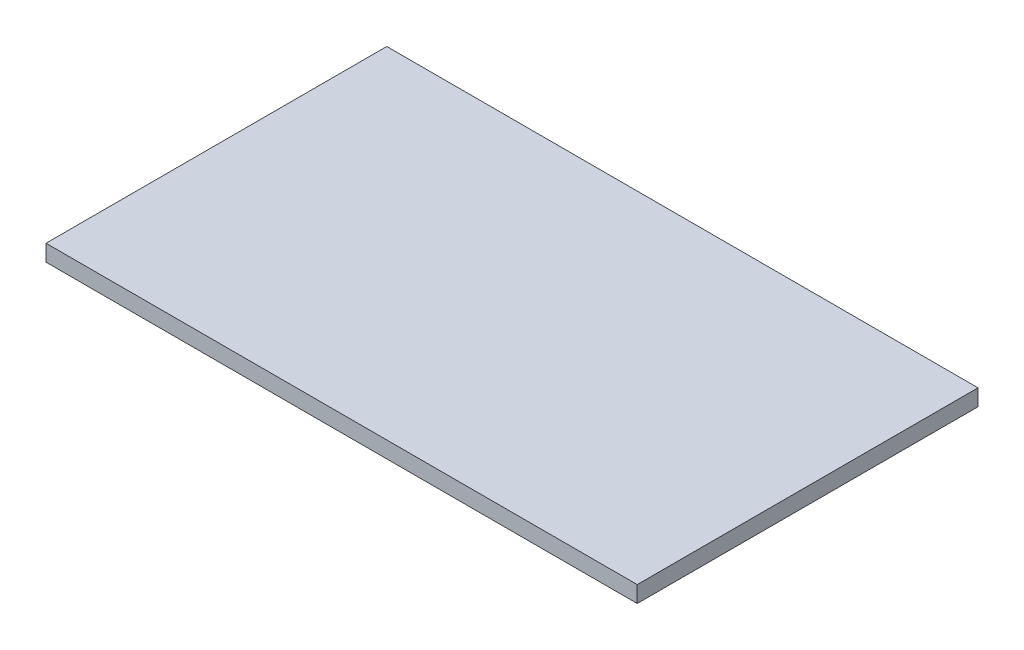
ISO-10303-21;
HEADER;
FILE_DESCRIPTION(('STEP AP214'),'2;1');
FILE_NAME('part.step','',(''),(''),'','','');
FILE_SCHEMA(('AUTOMOTIVE_DESIGN { 1 0 10303 214 1 1 1 1 }'));
ENDSEC;
DATA;
#1=APPLICATION_CONTEXT('core data for automotive mechanical design processes');
#2=APPLICATION_PROTOCOL_DEFINITION('international standard','automotive_design',2000,#1);
#3=PRODUCT_CONTEXT('',#1,'mechanical');
#4=PRODUCT('Part','Part','',(#3));
#5=PRODUCT_RELATED_PRODUCT_CATEGORY('part','',(#4));
#6=PRODUCT_DEFINITION_FORMATION('','',#4);
#7=PRODUCT_DEFINITION_CONTEXT('part definition',#1,'design');
#8=PRODUCT_DEFINITION('design','',#6,#7);
#9=PRODUCT_DEFINITION_SHAPE('','',#8);
#10=(LENGTH_UNIT() NAMED_UNIT(*) SI_UNIT(.MILLI.,.METRE.));
#11=(NAMED_UNIT(*) PLANE_ANGLE_UNIT() SI_UNIT($,.RADIAN.));
#12=(NAMED_UNIT(*) SI_UNIT($,.STERADIAN.) SOLID_ANGLE_UNIT());
#13=UNCERTAINTY_MEASURE_WITH_UNIT(LENGTH_MEASURE(1.E-05),#10,'distance_accuracy_value','');
#14=(GEOMETRIC_REPRESENTATION_CONTEXT(3) GLOBAL_UNCERTAINTY_ASSIGNED_CONTEXT((#13)) GLOBAL_UNIT_ASSIGNED_CONTEXT((#10,
#11,#12)) REPRESENTATION_CONTEXT('',''));
#15=CARTESIAN_POINT('',(0.,0.,0.));
#16=DIRECTION('',(0.,0.,1.));
#17=DIRECTION('',(1.,0.,0.));
#18=AXIS2_PLACEMENT_3D('',#15,#16,#17);
#19=CARTESIAN_POINT('',(-360.,10.,207.5));
#20=DIRECTION('',(1.,0.,0.));
#21=DIRECTION('',(0.,0.,-1.));
#22=AXIS2_PLACEMENT_3D('',#19,#20,#21);
#23=PLANE('',#22);
#24=DIRECTION('',(0.,0.,1.));
#25=VECTOR('',#24,1.);
#26=CARTESIAN_POINT('',(-360.,-10.,207.5));
#27=LINE('',#26,#25);
#28=CARTESIAN_POINT('',(-360.,-10.,-207.5));
#29=VERTEX_POINT('',#28);
#30=CARTESIAN_POINT('',(-360.,-10.,207.5));
#31=VERTEX_POINT('',#30);
#32=EDGE_CURVE('E101',#29,#31,#27,.T.);
#33=ORIENTED_EDGE('',*,*,#32,.T.);
#34=DIRECTION('',(0.,-1.,0.));
#35=VECTOR('',#34,1.);
#36=CARTESIAN_POINT('',(-360.,10.,207.5));
#37=LINE('',#36,#35);
#38=CARTESIAN_POINT('',(-360.,10.,207.5));
#39=VERTEX_POINT('',#38);
#40=EDGE_CURVE('E11',#39,#31,#37,.T.);
#41=ORIENTED_EDGE('',*,*,#40,.F.);
#42=DIRECTION('',(0.,0.,1.));
#43=VECTOR('',#42,1.);
#44=CARTESIAN_POINT('',(-360.,10.,207.5));
#45=LINE('',#44,#43);
#46=CARTESIAN_POINT('',(-360.,10.,-207.5));
#47=VERTEX_POINT('',#46);
#48=EDGE_CURVE('E89',#47,#39,#45,.T.);
#49=ORIENTED_EDGE('',*,*,#48,.F.);
#50=DIRECTION('',(0.,-1.,0.));
#51=VECTOR('',#50,1.);
#52=CARTESIAN_POINT('',(-360.,10.,-207.5));
#53=LINE('',#52,#51);
#54=EDGE_CURVE('E97',#47,#29,#53,.T.);
#55=ORIENTED_EDGE('',*,*,#54,.T.);
#56=EDGE_LOOP('',(#33,#41,#49,#55));
#57=FACE_BOUND('',#56,.T.);
#58=ADVANCED_FACE('F38',(#57),#23,.F.);
#59=CARTESIAN_POINT('',(360.,10.,207.5));
#60=DIRECTION('',(0.,0.,-1.));
#61=DIRECTION('',(-1.,0.,0.));
#62=AXIS2_PLACEMENT_3D('',#59,#60,#61);
#63=PLANE('',#62);
#64=DIRECTION('',(1.,0.,0.));
#65=VECTOR('',#64,1.);
#66=CARTESIAN_POINT('',(360.,-10.,207.5));
#67=LINE('',#66,#65);
#68=CARTESIAN_POINT('',(360.,-10.,207.5));
#69=VERTEX_POINT('',#68);
#70=EDGE_CURVE('E93',#31,#69,#67,.T.);
#71=ORIENTED_EDGE('',*,*,#70,.T.);
#72=DIRECTION('',(0.,-1.,0.));
#73=VECTOR('',#72,1.);
#74=CARTESIAN_POINT('',(360.,10.,207.5));
#75=LINE('',#74,#73);
#76=CARTESIAN_POINT('',(360.,10.,207.5));
#77=VERTEX_POINT('',#76);
#78=EDGE_CURVE('E46',#77,#69,#75,.T.);
#79=ORIENTED_EDGE('',*,*,#78,.F.);
#80=DIRECTION('',(1.,0.,0.));
#81=VECTOR('',#80,1.);
#82=CARTESIAN_POINT('',(360.,10.,207.5));
#83=LINE('',#82,#81);
#84=EDGE_CURVE('E84',#39,#77,#83,.T.);
#85=ORIENTED_EDGE('',*,*,#84,.F.);
#86=ORIENTED_EDGE('',*,*,#40,.T.);
#87=EDGE_LOOP('',(#71,#79,#85,#86));
#88=FACE_BOUND('',#87,.T.);
#89=ADVANCED_FACE('F92',(#88),#63,.F.);
#90=CARTESIAN_POINT('',(360.,10.,207.5));
#91=DIRECTION('',(-1.,0.,0.));
#92=DIRECTION('',(0.,0.,1.));
#93=AXIS2_PLACEMENT_3D('',#90,#91,#92);
#94=PLANE('',#93);
#95=DIRECTION('',(0.,0.,-1.));
#96=VECTOR('',#95,1.);
#97=CARTESIAN_POINT('',(360.,-10.,207.5));
#98=LINE('',#97,#96);
#99=CARTESIAN_POINT('',(360.,-10.,-207.5));
#100=VERTEX_POINT('',#99);
#101=EDGE_CURVE('E71',#69,#100,#98,.T.);
#102=ORIENTED_EDGE('',*,*,#101,.T.);
#103=DIRECTION('',(0.,-1.,0.));
#104=VECTOR('',#103,1.);
#105=CARTESIAN_POINT('',(360.,10.,-207.5));
#106=LINE('',#105,#104);
#107=CARTESIAN_POINT('',(360.,10.,-207.5));
#108=VERTEX_POINT('',#107);
#109=EDGE_CURVE('E94',#108,#100,#106,.T.);
#110=ORIENTED_EDGE('',*,*,#109,.F.);
#111=DIRECTION('',(0.,0.,-1.));
#112=VECTOR('',#111,1.);
#113=CARTESIAN_POINT('',(360.,10.,207.5));
#114=LINE('',#113,#112);
#115=EDGE_CURVE('E87',#77,#108,#114,.T.);
#116=ORIENTED_EDGE('',*,*,#115,.F.);
#117=ORIENTED_EDGE('',*,*,#78,.T.);
#118=EDGE_LOOP('',(#102,#110,#116,#117));
#119=FACE_BOUND('',#118,.T.);
#120=ADVANCED_FACE('F95',(#119),#94,.F.);
#121=CARTESIAN_POINT('',(360.,10.,-207.5));
#122=DIRECTION('',(0.,0.,1.));
#123=DIRECTION('',(1.,0.,0.));
#124=AXIS2_PLACEMENT_3D('',#121,#122,#123);
#125=PLANE('',#124);
#126=DIRECTION('',(-1.,0.,0.));
#127=VECTOR('',#126,1.);
#128=CARTESIAN_POINT('',(360.,-10.,-207.5));
#129=LINE('',#128,#127);
#130=EDGE_CURVE('E77',#100,#29,#129,.T.);
#131=ORIENTED_EDGE('',*,*,#130,.T.);
#132=ORIENTED_EDGE('',*,*,#54,.F.);
#133=DIRECTION('',(-1.,0.,0.));
#134=VECTOR('',#133,1.);
#135=CARTESIAN_POINT('',(360.,10.,-207.5));
#136=LINE('',#135,#134);
#137=EDGE_CURVE('E54',#108,#47,#136,.T.);
#138=ORIENTED_EDGE('',*,*,#137,.F.);
#139=ORIENTED_EDGE('',*,*,#109,.T.);
#140=EDGE_LOOP('',(#131,#132,#138,#139));
#141=FACE_BOUND('',#140,.T.);
#142=ADVANCED_FACE('F108',(#141),#125,.F.);
#143=CARTESIAN_POINT('',(0.,10.,0.));
#144=DIRECTION('',(0.,1.,0.));
#145=DIRECTION('',(0.,0.,1.));
#146=AXIS2_PLACEMENT_3D('',#143,#144,#145);
#147=PLANE('',#146);
#148=ORIENTED_EDGE('',*,*,#48,.T.);
#149=ORIENTED_EDGE('',*,*,#84,.T.);
#150=ORIENTED_EDGE('',*,*,#115,.T.);
#151=ORIENTED_EDGE('',*,*,#137,.T.);
#152=EDGE_LOOP('',(#148,#149,#150,#151));
#153=FACE_BOUND('',#152,.T.);
#154=ADVANCED_FACE('F85',(#153),#147,.T.);
#155=CARTESIAN_POINT('',(0.,-10.,0.));
#156=DIRECTION('',(0.,1.,0.));
#157=DIRECTION('',(0.,0.,1.));
#158=AXIS2_PLACEMENT_3D('',#155,#156,#157);
#159=PLANE('',#158);
#160=ORIENTED_EDGE('',*,*,#32,.F.);
#161=ORIENTED_EDGE('',*,*,#130,.F.);
#162=ORIENTED_EDGE('',*,*,#101,.F.);
#163=ORIENTED_EDGE('',*,*,#70,.F.);
#164=EDGE_LOOP('',(#160,#161,#162,#163));
#165=FACE_BOUND('',#164,.T.);
#166=ADVANCED_FACE('F111',(#165),#159,.F.);
#167=CLOSED_SHELL('',(#58,#89,#120,#142,#154,#166));
#168=MANIFOLD_SOLID_BREP('B2',#167);
#169=ADVANCED_BREP_SHAPE_REPRESENTATION('',(#18,#168),#14);
#170=SHAPE_DEFINITION_REPRESENTATION(#9,#169);
ENDSEC;
END-ISO-10303-21;
